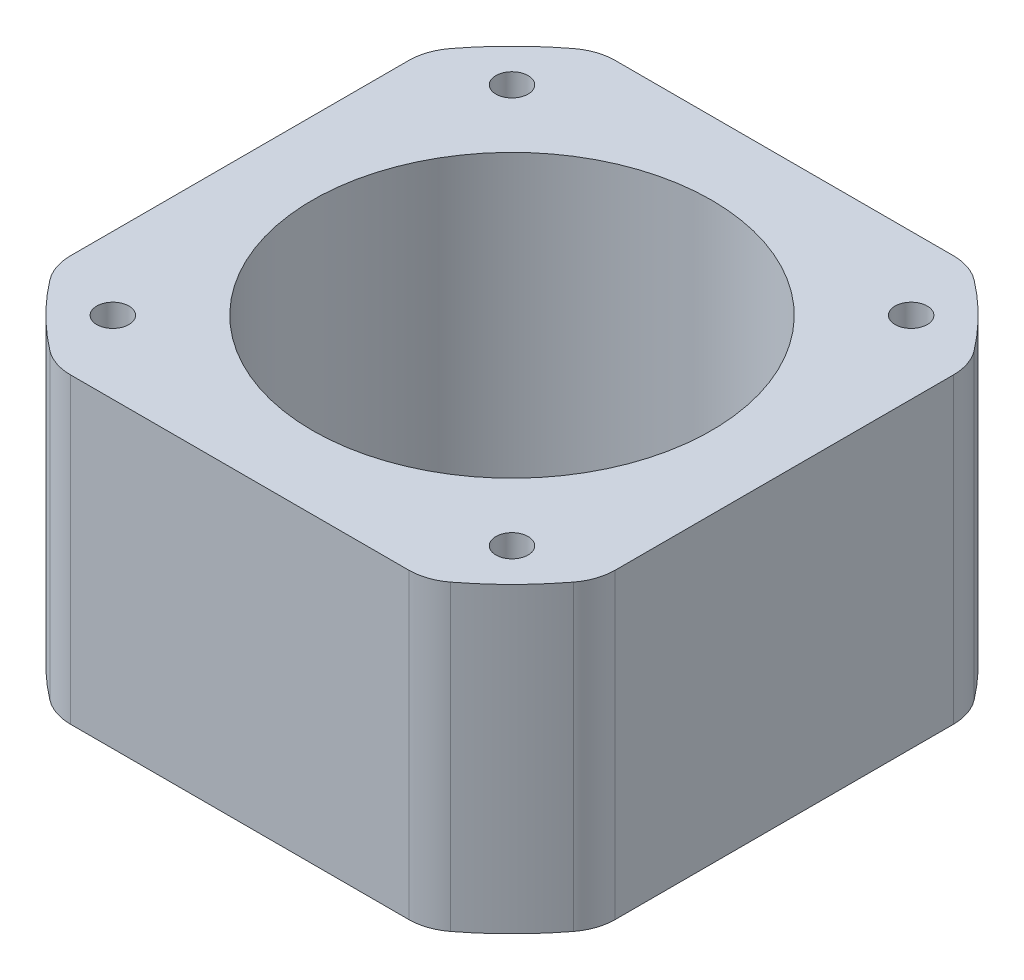
ISO-10303-21;
HEADER;
FILE_DESCRIPTION(('STEP AP214'),'2;1');
FILE_NAME('part.step','',(''),(''),'','','');
FILE_SCHEMA(('AUTOMOTIVE_DESIGN { 1 0 10303 214 1 1 1 1 }'));
ENDSEC;
DATA;
#1=APPLICATION_CONTEXT('core data for automotive mechanical design processes');
#2=APPLICATION_PROTOCOL_DEFINITION('international standard','automotive_design',2000,#1);
#3=PRODUCT_CONTEXT('',#1,'mechanical');
#4=PRODUCT('Part','Part','',(#3));
#5=PRODUCT_RELATED_PRODUCT_CATEGORY('part','',(#4));
#6=PRODUCT_DEFINITION_FORMATION('','',#4);
#7=PRODUCT_DEFINITION_CONTEXT('part definition',#1,'design');
#8=PRODUCT_DEFINITION('design','',#6,#7);
#9=PRODUCT_DEFINITION_SHAPE('','',#8);
#10=(LENGTH_UNIT() NAMED_UNIT(*) SI_UNIT(.MILLI.,.METRE.));
#11=(NAMED_UNIT(*) PLANE_ANGLE_UNIT() SI_UNIT($,.RADIAN.));
#12=(NAMED_UNIT(*) SI_UNIT($,.STERADIAN.) SOLID_ANGLE_UNIT());
#13=UNCERTAINTY_MEASURE_WITH_UNIT(LENGTH_MEASURE(1.E-05),#10,'distance_accuracy_value','');
#14=(GEOMETRIC_REPRESENTATION_CONTEXT(3) GLOBAL_UNCERTAINTY_ASSIGNED_CONTEXT((#13)) GLOBAL_UNIT_ASSIGNED_CONTEXT((#10,
#11,#12)) REPRESENTATION_CONTEXT('',''));
#15=CARTESIAN_POINT('',(0.,0.,0.));
#16=DIRECTION('',(0.,0.,1.));
#17=DIRECTION('',(1.,0.,0.));
#18=AXIS2_PLACEMENT_3D('',#15,#16,#17);
#19=CARTESIAN_POINT('',(0.,23.5,0.));
#20=DIRECTION('',(0.,1.,0.));
#21=DIRECTION('',(0.,0.,1.));
#22=AXIS2_PLACEMENT_3D('',#19,#20,#21);
#23=PLANE('',#22);
#24=CARTESIAN_POINT('',(15.5,23.5,15.5));
#25=DIRECTION('',(0.,1.,0.));
#26=DIRECTION('',(0.,0.,1.));
#27=AXIS2_PLACEMENT_3D('',#24,#25,#26);
#28=CIRCLE('',#27,1.25000000000001);
#29=CARTESIAN_POINT('',(15.5,23.5,16.75));
#30=VERTEX_POINT('',#29);
#31=EDGE_CURVE('E320',#30,#30,#28,.T.);
#32=ORIENTED_EDGE('',*,*,#31,.F.);
#33=EDGE_LOOP('',(#32));
#34=FACE_BOUND('',#33,.T.);
#35=CARTESIAN_POINT('',(-15.5,23.5,-15.5));
#36=DIRECTION('',(0.,1.,0.));
#37=DIRECTION('',(0.,0.,1.));
#38=AXIS2_PLACEMENT_3D('',#35,#36,#37);
#39=CIRCLE('',#38,1.25000000000001);
#40=CARTESIAN_POINT('',(-15.5,23.5,-14.25));
#41=VERTEX_POINT('',#40);
#42=EDGE_CURVE('E308',#41,#41,#39,.T.);
#43=ORIENTED_EDGE('',*,*,#42,.F.);
#44=EDGE_LOOP('',(#43));
#45=FACE_BOUND('',#44,.T.);
#46=CARTESIAN_POINT('',(0.,23.5,0.));
#47=DIRECTION('',(0.,1.,0.));
#48=DIRECTION('',(0.,0.,1.));
#49=AXIS2_PLACEMENT_3D('',#46,#47,#48);
#50=CIRCLE('',#49,25.6);
#51=CARTESIAN_POINT('',(-15.563313761978,23.5,-20.3259259259259));
#52=VERTEX_POINT('',#51);
#53=CARTESIAN_POINT('',(-20.3259259259259,23.5,-15.563313761978));
#54=VERTEX_POINT('',#53);
#55=EDGE_CURVE('E296',#52,#54,#50,.T.);
#56=ORIENTED_EDGE('',*,*,#55,.T.);
#57=CARTESIAN_POINT('',(-17.15,23.5,-13.1315459866689));
#58=DIRECTION('',(0.,1.,0.));
#59=DIRECTION('',(0.,0.,1.));
#60=AXIS2_PLACEMENT_3D('',#57,#58,#59);
#61=CIRCLE('',#60,4.);
#62=CARTESIAN_POINT('',(-21.15,23.5,-13.1315459866689));
#63=VERTEX_POINT('',#62);
#64=EDGE_CURVE('E224',#54,#63,#61,.T.);
#65=ORIENTED_EDGE('',*,*,#64,.T.);
#66=DIRECTION('',(0.,0.,1.));
#67=VECTOR('',#66,1.);
#68=CARTESIAN_POINT('',(-21.15,23.5,14.4235051218489));
#69=LINE('',#68,#67);
#70=CARTESIAN_POINT('',(-21.15,23.5,13.1315459866689));
#71=VERTEX_POINT('',#70);
#72=EDGE_CURVE('E169',#63,#71,#69,.T.);
#73=ORIENTED_EDGE('',*,*,#72,.T.);
#74=CARTESIAN_POINT('',(-17.15,23.5,13.1315459866689));
#75=DIRECTION('',(0.,1.,0.));
#76=DIRECTION('',(0.,0.,1.));
#77=AXIS2_PLACEMENT_3D('',#74,#75,#76);
#78=CIRCLE('',#77,4.);
#79=CARTESIAN_POINT('',(-20.3259259259259,23.5,15.563313761978));
#80=VERTEX_POINT('',#79);
#81=EDGE_CURVE('E211',#71,#80,#78,.T.);
#82=ORIENTED_EDGE('',*,*,#81,.T.);
#83=CARTESIAN_POINT('',(0.,23.5,0.));
#84=DIRECTION('',(0.,1.,0.));
#85=DIRECTION('',(0.,0.,1.));
#86=AXIS2_PLACEMENT_3D('',#83,#84,#85);
#87=CIRCLE('',#86,25.6);
#88=CARTESIAN_POINT('',(-15.563313761978,23.5,20.3259259259259));
#89=VERTEX_POINT('',#88);
#90=EDGE_CURVE('E256',#80,#89,#87,.T.);
#91=ORIENTED_EDGE('',*,*,#90,.T.);
#92=CARTESIAN_POINT('',(-13.1315459866689,23.5,17.15));
#93=DIRECTION('',(0.,1.,0.));
#94=DIRECTION('',(0.,0.,1.));
#95=AXIS2_PLACEMENT_3D('',#92,#93,#94);
#96=CIRCLE('',#95,4.);
#97=CARTESIAN_POINT('',(-13.1315459866689,23.5,21.15));
#98=VERTEX_POINT('',#97);
#99=EDGE_CURVE('E213',#89,#98,#96,.T.);
#100=ORIENTED_EDGE('',*,*,#99,.T.);
#101=DIRECTION('',(1.,0.,0.));
#102=VECTOR('',#101,1.);
#103=CARTESIAN_POINT('',(-14.4235051218489,23.5,21.15));
#104=LINE('',#103,#102);
#105=CARTESIAN_POINT('',(13.1315459866689,23.5,21.15));
#106=VERTEX_POINT('',#105);
#107=EDGE_CURVE('E269',#98,#106,#104,.T.);
#108=ORIENTED_EDGE('',*,*,#107,.T.);
#109=CARTESIAN_POINT('',(13.1315459866689,23.5,17.15));
#110=DIRECTION('',(0.,1.,0.));
#111=DIRECTION('',(0.,0.,1.));
#112=AXIS2_PLACEMENT_3D('',#109,#110,#111);
#113=CIRCLE('',#112,4.);
#114=CARTESIAN_POINT('',(15.563313761978,23.5,20.3259259259259));
#115=VERTEX_POINT('',#114);
#116=EDGE_CURVE('E215',#106,#115,#113,.T.);
#117=ORIENTED_EDGE('',*,*,#116,.T.);
#118=CARTESIAN_POINT('',(0.,23.5,0.));
#119=DIRECTION('',(0.,1.,0.));
#120=DIRECTION('',(0.,0.,1.));
#121=AXIS2_PLACEMENT_3D('',#118,#119,#120);
#122=CIRCLE('',#121,25.6);
#123=CARTESIAN_POINT('',(20.3259259259259,23.5,15.563313761978));
#124=VERTEX_POINT('',#123);
#125=EDGE_CURVE('E271',#115,#124,#122,.T.);
#126=ORIENTED_EDGE('',*,*,#125,.T.);
#127=CARTESIAN_POINT('',(17.15,23.5,13.1315459866689));
#128=DIRECTION('',(0.,1.,0.));
#129=DIRECTION('',(0.,0.,1.));
#130=AXIS2_PLACEMENT_3D('',#127,#128,#129);
#131=CIRCLE('',#130,4.);
#132=CARTESIAN_POINT('',(21.15,23.5,13.1315459866689));
#133=VERTEX_POINT('',#132);
#134=EDGE_CURVE('E57',#124,#133,#131,.T.);
#135=ORIENTED_EDGE('',*,*,#134,.T.);
#136=DIRECTION('',(0.,0.,-1.));
#137=VECTOR('',#136,1.);
#138=CARTESIAN_POINT('',(21.15,23.5,14.4235051218489));
#139=LINE('',#138,#137);
#140=CARTESIAN_POINT('',(21.15,23.5,-13.1315459866689));
#141=VERTEX_POINT('',#140);
#142=EDGE_CURVE('E194',#133,#141,#139,.T.);
#143=ORIENTED_EDGE('',*,*,#142,.T.);
#144=CARTESIAN_POINT('',(17.15,23.5,-13.1315459866689));
#145=DIRECTION('',(0.,1.,0.));
#146=DIRECTION('',(0.,0.,1.));
#147=AXIS2_PLACEMENT_3D('',#144,#145,#146);
#148=CIRCLE('',#147,4.);
#149=CARTESIAN_POINT('',(20.3259259259259,23.5,-15.563313761978));
#150=VERTEX_POINT('',#149);
#151=EDGE_CURVE('E218',#141,#150,#148,.T.);
#152=ORIENTED_EDGE('',*,*,#151,.T.);
#153=CARTESIAN_POINT('',(0.,23.5,0.));
#154=DIRECTION('',(0.,1.,0.));
#155=DIRECTION('',(0.,0.,1.));
#156=AXIS2_PLACEMENT_3D('',#153,#154,#155);
#157=CIRCLE('',#156,25.6);
#158=CARTESIAN_POINT('',(15.563313761978,23.5,-20.3259259259259));
#159=VERTEX_POINT('',#158);
#160=EDGE_CURVE('E193',#150,#159,#157,.T.);
#161=ORIENTED_EDGE('',*,*,#160,.T.);
#162=CARTESIAN_POINT('',(13.1315459866689,23.5,-17.15));
#163=DIRECTION('',(0.,1.,0.));
#164=DIRECTION('',(0.,0.,1.));
#165=AXIS2_PLACEMENT_3D('',#162,#163,#164);
#166=CIRCLE('',#165,4.);
#167=CARTESIAN_POINT('',(13.1315459866689,23.5,-21.15));
#168=VERTEX_POINT('',#167);
#169=EDGE_CURVE('E220',#159,#168,#166,.T.);
#170=ORIENTED_EDGE('',*,*,#169,.T.);
#171=DIRECTION('',(-1.,0.,0.));
#172=VECTOR('',#171,1.);
#173=CARTESIAN_POINT('',(-14.4235051218489,23.5,-21.15));
#174=LINE('',#173,#172);
#175=CARTESIAN_POINT('',(-13.131545986669,23.5,-21.15));
#176=VERTEX_POINT('',#175);
#177=EDGE_CURVE('E297',#168,#176,#174,.T.);
#178=ORIENTED_EDGE('',*,*,#177,.T.);
#179=CARTESIAN_POINT('',(-13.131545986669,23.5,-17.15));
#180=DIRECTION('',(0.,1.,0.));
#181=DIRECTION('',(0.,0.,1.));
#182=AXIS2_PLACEMENT_3D('',#179,#180,#181);
#183=CIRCLE('',#182,4.);
#184=EDGE_CURVE('E222',#176,#52,#183,.T.);
#185=ORIENTED_EDGE('',*,*,#184,.T.);
#186=EDGE_LOOP('',(#56,#65,#73,#82,#91,#100,#108,#117,#126,#135,#143,#152,#161,#170,#178,#185));
#187=FACE_BOUND('',#186,.T.);
#188=CARTESIAN_POINT('',(0.,23.5,0.));
#189=DIRECTION('',(0.,1.,0.));
#190=DIRECTION('',(0.,0.,1.));
#191=AXIS2_PLACEMENT_3D('',#188,#189,#190);
#192=CIRCLE('',#191,15.5);
#193=CARTESIAN_POINT('',(0.,23.5,15.5));
#194=VERTEX_POINT('',#193);
#195=EDGE_CURVE('E280',#194,#194,#192,.T.);
#196=ORIENTED_EDGE('',*,*,#195,.F.);
#197=EDGE_LOOP('',(#196));
#198=FACE_BOUND('',#197,.T.);
#199=CARTESIAN_POINT('',(15.5,23.5,-15.5));
#200=DIRECTION('',(0.,1.,0.));
#201=DIRECTION('',(0.,0.,1.));
#202=AXIS2_PLACEMENT_3D('',#199,#200,#201);
#203=CIRCLE('',#202,1.25000000000001);
#204=CARTESIAN_POINT('',(15.5,23.5,-14.25));
#205=VERTEX_POINT('',#204);
#206=EDGE_CURVE('E314',#205,#205,#203,.T.);
#207=ORIENTED_EDGE('',*,*,#206,.F.);
#208=EDGE_LOOP('',(#207));
#209=FACE_BOUND('',#208,.T.);
#210=CARTESIAN_POINT('',(-15.5,23.5,15.5));
#211=DIRECTION('',(0.,1.,0.));
#212=DIRECTION('',(0.,0.,1.));
#213=AXIS2_PLACEMENT_3D('',#210,#211,#212);
#214=CIRCLE('',#213,1.25000000000001);
#215=CARTESIAN_POINT('',(-15.5,23.5,16.75));
#216=VERTEX_POINT('',#215);
#217=EDGE_CURVE('E326',#216,#216,#214,.T.);
#218=ORIENTED_EDGE('',*,*,#217,.F.);
#219=EDGE_LOOP('',(#218));
#220=FACE_BOUND('',#219,.T.);
#221=ADVANCED_FACE('F35',(#34,#45,#187,#198,#209,#220),#23,.T.);
#222=CARTESIAN_POINT('',(0.,0.,0.));
#223=DIRECTION('',(0.,1.,0.));
#224=DIRECTION('',(0.,0.,1.));
#225=AXIS2_PLACEMENT_3D('',#222,#223,#224);
#226=PLANE('',#225);
#227=CARTESIAN_POINT('',(15.5,0.,15.5));
#228=DIRECTION('',(0.,1.,0.));
#229=DIRECTION('',(0.,0.,1.));
#230=AXIS2_PLACEMENT_3D('',#227,#228,#229);
#231=CIRCLE('',#230,1.25000000000001);
#232=CARTESIAN_POINT('',(15.5,0.,16.75));
#233=VERTEX_POINT('',#232);
#234=EDGE_CURVE('E323',#233,#233,#231,.T.);
#235=ORIENTED_EDGE('',*,*,#234,.T.);
#236=EDGE_LOOP('',(#235));
#237=FACE_BOUND('',#236,.T.);
#238=CARTESIAN_POINT('',(-15.5,0.,-15.5));
#239=DIRECTION('',(0.,1.,0.));
#240=DIRECTION('',(0.,0.,1.));
#241=AXIS2_PLACEMENT_3D('',#238,#239,#240);
#242=CIRCLE('',#241,1.25000000000001);
#243=CARTESIAN_POINT('',(-15.5,0.,-14.25));
#244=VERTEX_POINT('',#243);
#245=EDGE_CURVE('E311',#244,#244,#242,.T.);
#246=ORIENTED_EDGE('',*,*,#245,.T.);
#247=EDGE_LOOP('',(#246));
#248=FACE_BOUND('',#247,.T.);
#249=DIRECTION('',(0.,0.,1.));
#250=VECTOR('',#249,1.);
#251=CARTESIAN_POINT('',(-21.15,0.,14.4235051218489));
#252=LINE('',#251,#250);
#253=CARTESIAN_POINT('',(-21.15,0.,-13.1315459866689));
#254=VERTEX_POINT('',#253);
#255=CARTESIAN_POINT('',(-21.15,0.,13.1315459866689));
#256=VERTEX_POINT('',#255);
#257=EDGE_CURVE('E166',#254,#256,#252,.T.);
#258=ORIENTED_EDGE('',*,*,#257,.F.);
#259=CARTESIAN_POINT('',(-17.15,0.,-13.1315459866689));
#260=DIRECTION('',(0.,1.,0.));
#261=DIRECTION('',(0.,0.,1.));
#262=AXIS2_PLACEMENT_3D('',#259,#260,#261);
#263=CIRCLE('',#262,4.);
#264=CARTESIAN_POINT('',(-20.3259259259259,0.,-15.563313761978));
#265=VERTEX_POINT('',#264);
#266=EDGE_CURVE('E149',#254,#265,#263,.F.);
#267=ORIENTED_EDGE('',*,*,#266,.T.);
#268=CARTESIAN_POINT('',(0.,0.,0.));
#269=DIRECTION('',(0.,1.,0.));
#270=DIRECTION('',(0.,0.,1.));
#271=AXIS2_PLACEMENT_3D('',#268,#269,#270);
#272=CIRCLE('',#271,25.6);
#273=CARTESIAN_POINT('',(-15.563313761978,0.,-20.3259259259259));
#274=VERTEX_POINT('',#273);
#275=EDGE_CURVE('E177',#274,#265,#272,.T.);
#276=ORIENTED_EDGE('',*,*,#275,.F.);
#277=CARTESIAN_POINT('',(-13.131545986669,0.,-17.15));
#278=DIRECTION('',(0.,1.,0.));
#279=DIRECTION('',(0.,0.,1.));
#280=AXIS2_PLACEMENT_3D('',#277,#278,#279);
#281=CIRCLE('',#280,4.);
#282=CARTESIAN_POINT('',(-13.131545986669,0.,-21.15));
#283=VERTEX_POINT('',#282);
#284=EDGE_CURVE('E160',#274,#283,#281,.F.);
#285=ORIENTED_EDGE('',*,*,#284,.T.);
#286=DIRECTION('',(-1.,0.,0.));
#287=VECTOR('',#286,1.);
#288=CARTESIAN_POINT('',(-14.4235051218489,0.,-21.15));
#289=LINE('',#288,#287);
#290=CARTESIAN_POINT('',(13.1315459866689,0.,-21.15));
#291=VERTEX_POINT('',#290);
#292=EDGE_CURVE('E182',#291,#283,#289,.T.);
#293=ORIENTED_EDGE('',*,*,#292,.F.);
#294=CARTESIAN_POINT('',(13.1315459866689,0.,-17.15));
#295=DIRECTION('',(0.,1.,0.));
#296=DIRECTION('',(0.,0.,1.));
#297=AXIS2_PLACEMENT_3D('',#294,#295,#296);
#298=CIRCLE('',#297,4.);
#299=CARTESIAN_POINT('',(15.563313761978,0.,-20.3259259259259));
#300=VERTEX_POINT('',#299);
#301=EDGE_CURVE('E205',#291,#300,#298,.F.);
#302=ORIENTED_EDGE('',*,*,#301,.T.);
#303=CARTESIAN_POINT('',(0.,0.,0.));
#304=DIRECTION('',(0.,1.,0.));
#305=DIRECTION('',(0.,0.,1.));
#306=AXIS2_PLACEMENT_3D('',#303,#304,#305);
#307=CIRCLE('',#306,25.6);
#308=CARTESIAN_POINT('',(20.3259259259259,0.,-15.563313761978));
#309=VERTEX_POINT('',#308);
#310=EDGE_CURVE('E278',#309,#300,#307,.T.);
#311=ORIENTED_EDGE('',*,*,#310,.F.);
#312=CARTESIAN_POINT('',(17.15,0.,-13.1315459866689));
#313=DIRECTION('',(0.,1.,0.));
#314=DIRECTION('',(0.,0.,1.));
#315=AXIS2_PLACEMENT_3D('',#312,#313,#314);
#316=CIRCLE('',#315,4.);
#317=CARTESIAN_POINT('',(21.15,0.,-13.1315459866689));
#318=VERTEX_POINT('',#317);
#319=EDGE_CURVE('E203',#309,#318,#316,.F.);
#320=ORIENTED_EDGE('',*,*,#319,.T.);
#321=DIRECTION('',(0.,0.,-1.));
#322=VECTOR('',#321,1.);
#323=CARTESIAN_POINT('',(21.15,0.,14.4235051218489));
#324=LINE('',#323,#322);
#325=CARTESIAN_POINT('',(21.15,0.,13.1315459866689));
#326=VERTEX_POINT('',#325);
#327=EDGE_CURVE('E191',#326,#318,#324,.T.);
#328=ORIENTED_EDGE('',*,*,#327,.F.);
#329=CARTESIAN_POINT('',(17.15,0.,13.1315459866689));
#330=DIRECTION('',(0.,1.,0.));
#331=DIRECTION('',(0.,0.,1.));
#332=AXIS2_PLACEMENT_3D('',#329,#330,#331);
#333=CIRCLE('',#332,4.);
#334=CARTESIAN_POINT('',(20.3259259259259,0.,15.563313761978));
#335=VERTEX_POINT('',#334);
#336=EDGE_CURVE('E201',#326,#335,#333,.F.);
#337=ORIENTED_EDGE('',*,*,#336,.T.);
#338=CARTESIAN_POINT('',(0.,0.,0.));
#339=DIRECTION('',(0.,1.,0.));
#340=DIRECTION('',(0.,0.,1.));
#341=AXIS2_PLACEMENT_3D('',#338,#339,#340);
#342=CIRCLE('',#341,25.6);
#343=CARTESIAN_POINT('',(15.563313761978,0.,20.3259259259259));
#344=VERTEX_POINT('',#343);
#345=EDGE_CURVE('E188',#344,#335,#342,.T.);
#346=ORIENTED_EDGE('',*,*,#345,.F.);
#347=CARTESIAN_POINT('',(13.1315459866689,0.,17.15));
#348=DIRECTION('',(0.,1.,0.));
#349=DIRECTION('',(0.,0.,1.));
#350=AXIS2_PLACEMENT_3D('',#347,#348,#349);
#351=CIRCLE('',#350,4.);
#352=CARTESIAN_POINT('',(13.1315459866689,0.,21.15));
#353=VERTEX_POINT('',#352);
#354=EDGE_CURVE('E199',#344,#353,#351,.F.);
#355=ORIENTED_EDGE('',*,*,#354,.T.);
#356=DIRECTION('',(1.,0.,0.));
#357=VECTOR('',#356,1.);
#358=CARTESIAN_POINT('',(-14.4235051218489,0.,21.15));
#359=LINE('',#358,#357);
#360=CARTESIAN_POINT('',(-13.1315459866689,0.,21.15));
#361=VERTEX_POINT('',#360);
#362=EDGE_CURVE('E180',#361,#353,#359,.T.);
#363=ORIENTED_EDGE('',*,*,#362,.F.);
#364=CARTESIAN_POINT('',(-13.1315459866689,0.,17.15));
#365=DIRECTION('',(0.,1.,0.));
#366=DIRECTION('',(0.,0.,1.));
#367=AXIS2_PLACEMENT_3D('',#364,#365,#366);
#368=CIRCLE('',#367,4.);
#369=CARTESIAN_POINT('',(-15.563313761978,0.,20.3259259259259));
#370=VERTEX_POINT('',#369);
#371=EDGE_CURVE('E197',#361,#370,#368,.F.);
#372=ORIENTED_EDGE('',*,*,#371,.T.);
#373=CARTESIAN_POINT('',(0.,0.,0.));
#374=DIRECTION('',(0.,1.,0.));
#375=DIRECTION('',(0.,0.,1.));
#376=AXIS2_PLACEMENT_3D('',#373,#374,#375);
#377=CIRCLE('',#376,25.6);
#378=CARTESIAN_POINT('',(-20.3259259259259,0.,15.563313761978));
#379=VERTEX_POINT('',#378);
#380=EDGE_CURVE('E176',#379,#370,#377,.T.);
#381=ORIENTED_EDGE('',*,*,#380,.F.);
#382=CARTESIAN_POINT('',(-17.15,0.,13.1315459866689));
#383=DIRECTION('',(0.,1.,0.));
#384=DIRECTION('',(0.,0.,1.));
#385=AXIS2_PLACEMENT_3D('',#382,#383,#384);
#386=CIRCLE('',#385,4.);
#387=EDGE_CURVE('E170',#379,#256,#386,.F.);
#388=ORIENTED_EDGE('',*,*,#387,.T.);
#389=EDGE_LOOP('',(#258,#267,#276,#285,#293,#302,#311,#320,#328,#337,#346,#355,#363,#372,#381,#388));
#390=FACE_BOUND('',#389,.T.);
#391=CARTESIAN_POINT('',(0.,0.,0.));
#392=DIRECTION('',(0.,1.,0.));
#393=DIRECTION('',(0.,0.,1.));
#394=AXIS2_PLACEMENT_3D('',#391,#392,#393);
#395=CIRCLE('',#394,15.5);
#396=CARTESIAN_POINT('',(0.,0.,15.5));
#397=VERTEX_POINT('',#396);
#398=EDGE_CURVE('E305',#397,#397,#395,.T.);
#399=ORIENTED_EDGE('',*,*,#398,.T.);
#400=EDGE_LOOP('',(#399));
#401=FACE_BOUND('',#400,.T.);
#402=CARTESIAN_POINT('',(15.5,0.,-15.5));
#403=DIRECTION('',(0.,1.,0.));
#404=DIRECTION('',(0.,0.,1.));
#405=AXIS2_PLACEMENT_3D('',#402,#403,#404);
#406=CIRCLE('',#405,1.25000000000001);
#407=CARTESIAN_POINT('',(15.5,0.,-14.25));
#408=VERTEX_POINT('',#407);
#409=EDGE_CURVE('E317',#408,#408,#406,.T.);
#410=ORIENTED_EDGE('',*,*,#409,.T.);
#411=EDGE_LOOP('',(#410));
#412=FACE_BOUND('',#411,.T.);
#413=CARTESIAN_POINT('',(-15.5,0.,15.5));
#414=DIRECTION('',(0.,1.,0.));
#415=DIRECTION('',(0.,0.,1.));
#416=AXIS2_PLACEMENT_3D('',#413,#414,#415);
#417=CIRCLE('',#416,1.25000000000001);
#418=CARTESIAN_POINT('',(-15.5,0.,16.75));
#419=VERTEX_POINT('',#418);
#420=EDGE_CURVE('E329',#419,#419,#417,.T.);
#421=ORIENTED_EDGE('',*,*,#420,.T.);
#422=EDGE_LOOP('',(#421));
#423=FACE_BOUND('',#422,.T.);
#424=ADVANCED_FACE('F173',(#237,#248,#390,#401,#412,#423),#226,.F.);
#425=CARTESIAN_POINT('',(0.,23.5,0.));
#426=DIRECTION('',(0.,-1.,0.));
#427=DIRECTION('',(0.,0.,-1.));
#428=AXIS2_PLACEMENT_3D('',#425,#426,#427);
#429=CYLINDRICAL_SURFACE('',#428,25.6);
#430=ORIENTED_EDGE('',*,*,#310,.T.);
#431=DIRECTION('',(0.,-1.,0.));
#432=VECTOR('',#431,1.);
#433=CARTESIAN_POINT('',(15.563313761978,23.5,-20.3259259259259));
#434=LINE('',#433,#432);
#435=EDGE_CURVE('E234',#300,#159,#434,.F.);
#436=ORIENTED_EDGE('',*,*,#435,.T.);
#437=ORIENTED_EDGE('',*,*,#160,.F.);
#438=DIRECTION('',(0.,-1.,0.));
#439=VECTOR('',#438,1.);
#440=CARTESIAN_POINT('',(20.3259259259259,23.5,-15.563313761978));
#441=LINE('',#440,#439);
#442=EDGE_CURVE('E231',#150,#309,#441,.T.);
#443=ORIENTED_EDGE('',*,*,#442,.T.);
#444=EDGE_LOOP('',(#430,#436,#437,#443));
#445=FACE_BOUND('',#444,.T.);
#446=ADVANCED_FACE('F344',(#445),#429,.T.);
#447=CARTESIAN_POINT('',(-14.4235051218489,23.5,-21.15));
#448=DIRECTION('',(0.,0.,1.));
#449=DIRECTION('',(1.,0.,0.));
#450=AXIS2_PLACEMENT_3D('',#447,#448,#449);
#451=PLANE('',#450);
#452=ORIENTED_EDGE('',*,*,#292,.T.);
#453=DIRECTION('',(0.,-1.,0.));
#454=VECTOR('',#453,1.);
#455=CARTESIAN_POINT('',(-13.131545986669,23.5,-21.15));
#456=LINE('',#455,#454);
#457=EDGE_CURVE('E229',#283,#176,#456,.F.);
#458=ORIENTED_EDGE('',*,*,#457,.T.);
#459=ORIENTED_EDGE('',*,*,#177,.F.);
#460=DIRECTION('',(0.,-1.,0.));
#461=VECTOR('',#460,1.);
#462=CARTESIAN_POINT('',(13.1315459866689,23.5,-21.15));
#463=LINE('',#462,#461);
#464=EDGE_CURVE('E226',#168,#291,#463,.T.);
#465=ORIENTED_EDGE('',*,*,#464,.T.);
#466=EDGE_LOOP('',(#452,#458,#459,#465));
#467=FACE_BOUND('',#466,.T.);
#468=ADVANCED_FACE('F285',(#467),#451,.F.);
#469=CARTESIAN_POINT('',(0.,23.5,0.));
#470=DIRECTION('',(0.,-1.,0.));
#471=DIRECTION('',(0.,0.,-1.));
#472=AXIS2_PLACEMENT_3D('',#469,#470,#471);
#473=CYLINDRICAL_SURFACE('',#472,25.6);
#474=ORIENTED_EDGE('',*,*,#275,.T.);
#475=DIRECTION('',(0.,-1.,0.));
#476=VECTOR('',#475,1.);
#477=CARTESIAN_POINT('',(-20.3259259259259,23.5,-15.563313761978));
#478=LINE('',#477,#476);
#479=EDGE_CURVE('E154',#265,#54,#478,.F.);
#480=ORIENTED_EDGE('',*,*,#479,.T.);
#481=ORIENTED_EDGE('',*,*,#55,.F.);
#482=DIRECTION('',(0.,-1.,0.));
#483=VECTOR('',#482,1.);
#484=CARTESIAN_POINT('',(-15.563313761978,23.5,-20.3259259259259));
#485=LINE('',#484,#483);
#486=EDGE_CURVE('E159',#52,#274,#485,.T.);
#487=ORIENTED_EDGE('',*,*,#486,.T.);
#488=EDGE_LOOP('',(#474,#480,#481,#487));
#489=FACE_BOUND('',#488,.T.);
#490=ADVANCED_FACE('F299',(#489),#473,.T.);
#491=CARTESIAN_POINT('',(-21.15,23.5,14.4235051218489));
#492=DIRECTION('',(1.,0.,0.));
#493=DIRECTION('',(0.,0.,-1.));
#494=AXIS2_PLACEMENT_3D('',#491,#492,#493);
#495=PLANE('',#494);
#496=ORIENTED_EDGE('',*,*,#72,.F.);
#497=DIRECTION('',(0.,-1.,0.));
#498=VECTOR('',#497,1.);
#499=CARTESIAN_POINT('',(-21.15,23.5,-13.1315459866689));
#500=LINE('',#499,#498);
#501=EDGE_CURVE('E153',#63,#254,#500,.T.);
#502=ORIENTED_EDGE('',*,*,#501,.T.);
#503=ORIENTED_EDGE('',*,*,#257,.T.);
#504=DIRECTION('',(0.,-1.,0.));
#505=VECTOR('',#504,1.);
#506=CARTESIAN_POINT('',(-21.15,23.5,13.1315459866689));
#507=LINE('',#506,#505);
#508=EDGE_CURVE('E171',#256,#71,#507,.F.);
#509=ORIENTED_EDGE('',*,*,#508,.T.);
#510=EDGE_LOOP('',(#496,#502,#503,#509));
#511=FACE_BOUND('',#510,.T.);
#512=ADVANCED_FACE('F165',(#511),#495,.F.);
#513=CARTESIAN_POINT('',(0.,23.5,0.));
#514=DIRECTION('',(0.,-1.,0.));
#515=DIRECTION('',(0.,0.,-1.));
#516=AXIS2_PLACEMENT_3D('',#513,#514,#515);
#517=CYLINDRICAL_SURFACE('',#516,25.6);
#518=ORIENTED_EDGE('',*,*,#380,.T.);
#519=DIRECTION('',(0.,-1.,0.));
#520=VECTOR('',#519,1.);
#521=CARTESIAN_POINT('',(-15.563313761978,23.5,20.3259259259259));
#522=LINE('',#521,#520);
#523=EDGE_CURVE('E11',#370,#89,#522,.F.);
#524=ORIENTED_EDGE('',*,*,#523,.T.);
#525=ORIENTED_EDGE('',*,*,#90,.F.);
#526=DIRECTION('',(0.,-1.,0.));
#527=VECTOR('',#526,1.);
#528=CARTESIAN_POINT('',(-20.3259259259259,23.5,15.563313761978));
#529=LINE('',#528,#527);
#530=EDGE_CURVE('E43',#80,#379,#529,.T.);
#531=ORIENTED_EDGE('',*,*,#530,.T.);
#532=EDGE_LOOP('',(#518,#524,#525,#531));
#533=FACE_BOUND('',#532,.T.);
#534=ADVANCED_FACE('F253',(#533),#517,.T.);
#535=CARTESIAN_POINT('',(-14.4235051218489,23.5,21.15));
#536=DIRECTION('',(0.,0.,-1.));
#537=DIRECTION('',(-1.,0.,0.));
#538=AXIS2_PLACEMENT_3D('',#535,#536,#537);
#539=PLANE('',#538);
#540=ORIENTED_EDGE('',*,*,#362,.T.);
#541=DIRECTION('',(0.,-1.,0.));
#542=VECTOR('',#541,1.);
#543=CARTESIAN_POINT('',(13.1315459866689,23.5,21.15));
#544=LINE('',#543,#542);
#545=EDGE_CURVE('E248',#353,#106,#544,.F.);
#546=ORIENTED_EDGE('',*,*,#545,.T.);
#547=ORIENTED_EDGE('',*,*,#107,.F.);
#548=DIRECTION('',(0.,-1.,0.));
#549=VECTOR('',#548,1.);
#550=CARTESIAN_POINT('',(-13.1315459866689,23.5,21.15));
#551=LINE('',#550,#549);
#552=EDGE_CURVE('E245',#98,#361,#551,.T.);
#553=ORIENTED_EDGE('',*,*,#552,.T.);
#554=EDGE_LOOP('',(#540,#546,#547,#553));
#555=FACE_BOUND('',#554,.T.);
#556=ADVANCED_FACE('F266',(#555),#539,.F.);
#557=CARTESIAN_POINT('',(0.,23.5,0.));
#558=DIRECTION('',(0.,-1.,0.));
#559=DIRECTION('',(0.,0.,-1.));
#560=AXIS2_PLACEMENT_3D('',#557,#558,#559);
#561=CYLINDRICAL_SURFACE('',#560,25.6);
#562=ORIENTED_EDGE('',*,*,#345,.T.);
#563=DIRECTION('',(0.,-1.,0.));
#564=VECTOR('',#563,1.);
#565=CARTESIAN_POINT('',(20.3259259259259,23.5,15.563313761978));
#566=LINE('',#565,#564);
#567=EDGE_CURVE('E243',#335,#124,#566,.F.);
#568=ORIENTED_EDGE('',*,*,#567,.T.);
#569=ORIENTED_EDGE('',*,*,#125,.F.);
#570=DIRECTION('',(0.,-1.,0.));
#571=VECTOR('',#570,1.);
#572=CARTESIAN_POINT('',(15.563313761978,23.5,20.3259259259259));
#573=LINE('',#572,#571);
#574=EDGE_CURVE('E240',#115,#344,#573,.T.);
#575=ORIENTED_EDGE('',*,*,#574,.T.);
#576=EDGE_LOOP('',(#562,#568,#569,#575));
#577=FACE_BOUND('',#576,.T.);
#578=ADVANCED_FACE('F356',(#577),#561,.T.);
#579=CARTESIAN_POINT('',(21.15,23.5,14.4235051218489));
#580=DIRECTION('',(-1.,0.,0.));
#581=DIRECTION('',(0.,0.,1.));
#582=AXIS2_PLACEMENT_3D('',#579,#580,#581);
#583=PLANE('',#582);
#584=ORIENTED_EDGE('',*,*,#327,.T.);
#585=DIRECTION('',(0.,-1.,0.));
#586=VECTOR('',#585,1.);
#587=CARTESIAN_POINT('',(21.15,23.5,-13.1315459866689));
#588=LINE('',#587,#586);
#589=EDGE_CURVE('E50',#318,#141,#588,.F.);
#590=ORIENTED_EDGE('',*,*,#589,.T.);
#591=ORIENTED_EDGE('',*,*,#142,.F.);
#592=DIRECTION('',(0.,-1.,0.));
#593=VECTOR('',#592,1.);
#594=CARTESIAN_POINT('',(21.15,23.5,13.1315459866689));
#595=LINE('',#594,#593);
#596=EDGE_CURVE('E236',#133,#326,#595,.T.);
#597=ORIENTED_EDGE('',*,*,#596,.T.);
#598=EDGE_LOOP('',(#584,#590,#591,#597));
#599=FACE_BOUND('',#598,.T.);
#600=ADVANCED_FACE('F353',(#599),#583,.F.);
#601=CARTESIAN_POINT('',(0.,23.5,0.));
#602=DIRECTION('',(0.,-1.,0.));
#603=DIRECTION('',(0.,0.,-1.));
#604=AXIS2_PLACEMENT_3D('',#601,#602,#603);
#605=CYLINDRICAL_SURFACE('',#604,15.5);
#606=ORIENTED_EDGE('',*,*,#195,.T.);
#607=EDGE_LOOP('',(#606));
#608=FACE_BOUND('',#607,.T.);
#609=ORIENTED_EDGE('',*,*,#398,.F.);
#610=EDGE_LOOP('',(#609));
#611=FACE_BOUND('',#610,.T.);
#612=ADVANCED_FACE('F350',(#608,#611),#605,.F.);
#613=CARTESIAN_POINT('',(-15.5,23.5,-15.5));
#614=DIRECTION('',(0.,-1.,0.));
#615=DIRECTION('',(0.,0.,-1.));
#616=AXIS2_PLACEMENT_3D('',#613,#614,#615);
#617=CYLINDRICAL_SURFACE('',#616,1.25000000000001);
#618=ORIENTED_EDGE('',*,*,#42,.T.);
#619=EDGE_LOOP('',(#618));
#620=FACE_BOUND('',#619,.T.);
#621=ORIENTED_EDGE('',*,*,#245,.F.);
#622=EDGE_LOOP('',(#621));
#623=FACE_BOUND('',#622,.T.);
#624=ADVANCED_FACE('F526',(#620,#623),#617,.F.);
#625=CARTESIAN_POINT('',(15.5,23.5,-15.5));
#626=DIRECTION('',(0.,-1.,0.));
#627=DIRECTION('',(0.,0.,-1.));
#628=AXIS2_PLACEMENT_3D('',#625,#626,#627);
#629=CYLINDRICAL_SURFACE('',#628,1.25000000000001);
#630=ORIENTED_EDGE('',*,*,#206,.T.);
#631=EDGE_LOOP('',(#630));
#632=FACE_BOUND('',#631,.T.);
#633=ORIENTED_EDGE('',*,*,#409,.F.);
#634=EDGE_LOOP('',(#633));
#635=FACE_BOUND('',#634,.T.);
#636=ADVANCED_FACE('F516',(#632,#635),#629,.F.);
#637=CARTESIAN_POINT('',(15.5,23.5,15.5));
#638=DIRECTION('',(0.,-1.,0.));
#639=DIRECTION('',(0.,0.,-1.));
#640=AXIS2_PLACEMENT_3D('',#637,#638,#639);
#641=CYLINDRICAL_SURFACE('',#640,1.25000000000001);
#642=ORIENTED_EDGE('',*,*,#31,.T.);
#643=EDGE_LOOP('',(#642));
#644=FACE_BOUND('',#643,.T.);
#645=ORIENTED_EDGE('',*,*,#234,.F.);
#646=EDGE_LOOP('',(#645));
#647=FACE_BOUND('',#646,.T.);
#648=ADVANCED_FACE('F507',(#644,#647),#641,.F.);
#649=CARTESIAN_POINT('',(-15.5,23.5,15.5));
#650=DIRECTION('',(0.,-1.,0.));
#651=DIRECTION('',(0.,0.,-1.));
#652=AXIS2_PLACEMENT_3D('',#649,#650,#651);
#653=CYLINDRICAL_SURFACE('',#652,1.25000000000001);
#654=ORIENTED_EDGE('',*,*,#217,.T.);
#655=EDGE_LOOP('',(#654));
#656=FACE_BOUND('',#655,.T.);
#657=ORIENTED_EDGE('',*,*,#420,.F.);
#658=EDGE_LOOP('',(#657));
#659=FACE_BOUND('',#658,.T.);
#660=ADVANCED_FACE('F335',(#656,#659),#653,.F.);
#661=CARTESIAN_POINT('',(-17.15,23.5,-13.1315459866689));
#662=DIRECTION('',(0.,-1.,0.));
#663=DIRECTION('',(0.,0.,-1.));
#664=AXIS2_PLACEMENT_3D('',#661,#662,#663);
#665=CYLINDRICAL_SURFACE('',#664,4.);
#666=ORIENTED_EDGE('',*,*,#64,.F.);
#667=ORIENTED_EDGE('',*,*,#479,.F.);
#668=ORIENTED_EDGE('',*,*,#266,.F.);
#669=ORIENTED_EDGE('',*,*,#501,.F.);
#670=EDGE_LOOP('',(#666,#667,#668,#669));
#671=FACE_BOUND('',#670,.T.);
#672=ADVANCED_FACE('F152',(#671),#665,.T.);
#673=CARTESIAN_POINT('',(-13.131545986669,23.5,-17.15));
#674=DIRECTION('',(0.,-1.,0.));
#675=DIRECTION('',(0.,0.,-1.));
#676=AXIS2_PLACEMENT_3D('',#673,#674,#675);
#677=CYLINDRICAL_SURFACE('',#676,4.);
#678=ORIENTED_EDGE('',*,*,#184,.F.);
#679=ORIENTED_EDGE('',*,*,#457,.F.);
#680=ORIENTED_EDGE('',*,*,#284,.F.);
#681=ORIENTED_EDGE('',*,*,#486,.F.);
#682=EDGE_LOOP('',(#678,#679,#680,#681));
#683=FACE_BOUND('',#682,.T.);
#684=ADVANCED_FACE('F291',(#683),#677,.T.);
#685=CARTESIAN_POINT('',(13.1315459866689,23.5,-17.15));
#686=DIRECTION('',(0.,-1.,0.));
#687=DIRECTION('',(0.,0.,-1.));
#688=AXIS2_PLACEMENT_3D('',#685,#686,#687);
#689=CYLINDRICAL_SURFACE('',#688,4.);
#690=ORIENTED_EDGE('',*,*,#169,.F.);
#691=ORIENTED_EDGE('',*,*,#435,.F.);
#692=ORIENTED_EDGE('',*,*,#301,.F.);
#693=ORIENTED_EDGE('',*,*,#464,.F.);
#694=EDGE_LOOP('',(#690,#691,#692,#693));
#695=FACE_BOUND('',#694,.T.);
#696=ADVANCED_FACE('F377',(#695),#689,.T.);
#697=CARTESIAN_POINT('',(17.15,23.5,-13.1315459866689));
#698=DIRECTION('',(0.,-1.,0.));
#699=DIRECTION('',(0.,0.,-1.));
#700=AXIS2_PLACEMENT_3D('',#697,#698,#699);
#701=CYLINDRICAL_SURFACE('',#700,4.);
#702=ORIENTED_EDGE('',*,*,#151,.F.);
#703=ORIENTED_EDGE('',*,*,#589,.F.);
#704=ORIENTED_EDGE('',*,*,#319,.F.);
#705=ORIENTED_EDGE('',*,*,#442,.F.);
#706=EDGE_LOOP('',(#702,#703,#704,#705));
#707=FACE_BOUND('',#706,.T.);
#708=ADVANCED_FACE('F380',(#707),#701,.T.);
#709=CARTESIAN_POINT('',(17.15,23.5,13.1315459866689));
#710=DIRECTION('',(0.,-1.,0.));
#711=DIRECTION('',(0.,0.,-1.));
#712=AXIS2_PLACEMENT_3D('',#709,#710,#711);
#713=CYLINDRICAL_SURFACE('',#712,4.);
#714=ORIENTED_EDGE('',*,*,#134,.F.);
#715=ORIENTED_EDGE('',*,*,#567,.F.);
#716=ORIENTED_EDGE('',*,*,#336,.F.);
#717=ORIENTED_EDGE('',*,*,#596,.F.);
#718=EDGE_LOOP('',(#714,#715,#716,#717));
#719=FACE_BOUND('',#718,.T.);
#720=ADVANCED_FACE('F384',(#719),#713,.T.);
#721=CARTESIAN_POINT('',(13.1315459866689,23.5,17.15));
#722=DIRECTION('',(0.,-1.,0.));
#723=DIRECTION('',(0.,0.,-1.));
#724=AXIS2_PLACEMENT_3D('',#721,#722,#723);
#725=CYLINDRICAL_SURFACE('',#724,4.);
#726=ORIENTED_EDGE('',*,*,#116,.F.);
#727=ORIENTED_EDGE('',*,*,#545,.F.);
#728=ORIENTED_EDGE('',*,*,#354,.F.);
#729=ORIENTED_EDGE('',*,*,#574,.F.);
#730=EDGE_LOOP('',(#726,#727,#728,#729));
#731=FACE_BOUND('',#730,.T.);
#732=ADVANCED_FACE('F388',(#731),#725,.T.);
#733=CARTESIAN_POINT('',(-13.1315459866689,23.5,17.15));
#734=DIRECTION('',(0.,-1.,0.));
#735=DIRECTION('',(0.,0.,-1.));
#736=AXIS2_PLACEMENT_3D('',#733,#734,#735);
#737=CYLINDRICAL_SURFACE('',#736,4.);
#738=ORIENTED_EDGE('',*,*,#99,.F.);
#739=ORIENTED_EDGE('',*,*,#523,.F.);
#740=ORIENTED_EDGE('',*,*,#371,.F.);
#741=ORIENTED_EDGE('',*,*,#552,.F.);
#742=EDGE_LOOP('',(#738,#739,#740,#741));
#743=FACE_BOUND('',#742,.T.);
#744=ADVANCED_FACE('F263',(#743),#737,.T.);
#745=CARTESIAN_POINT('',(-17.15,23.5,13.1315459866689));
#746=DIRECTION('',(0.,-1.,0.));
#747=DIRECTION('',(0.,0.,-1.));
#748=AXIS2_PLACEMENT_3D('',#745,#746,#747);
#749=CYLINDRICAL_SURFACE('',#748,4.);
#750=ORIENTED_EDGE('',*,*,#81,.F.);
#751=ORIENTED_EDGE('',*,*,#508,.F.);
#752=ORIENTED_EDGE('',*,*,#387,.F.);
#753=ORIENTED_EDGE('',*,*,#530,.F.);
#754=EDGE_LOOP('',(#750,#751,#752,#753));
#755=FACE_BOUND('',#754,.T.);
#756=ADVANCED_FACE('F37',(#755),#749,.T.);
#757=CLOSED_SHELL('',(#221,#424,#446,#468,#490,#512,#534,#556,#578,#600,#612,#624,#636,#648,
#660,#672,#684,#696,#708,#720,#732,#744,#756));
#758=MANIFOLD_SOLID_BREP('B2',#757);
#759=ADVANCED_BREP_SHAPE_REPRESENTATION('',(#18,#758),#14);
#760=SHAPE_DEFINITION_REPRESENTATION(#9,#759);
ENDSEC;
END-ISO-10303-21;
